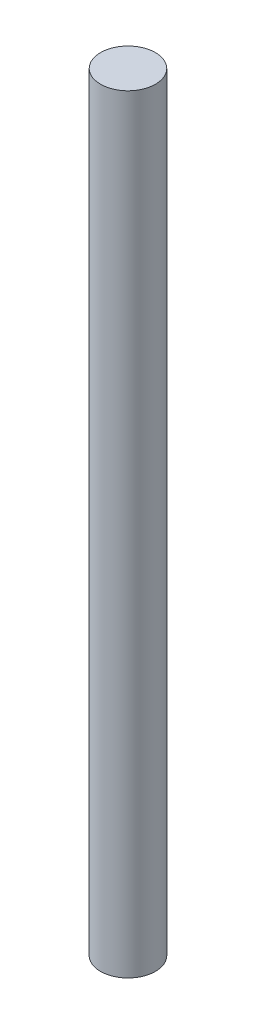
ISO-10303-21;
HEADER;
FILE_DESCRIPTION(('STEP AP214'),'2;1');
FILE_NAME('part.step','',(''),(''),'','','');
FILE_SCHEMA(('AUTOMOTIVE_DESIGN { 1 0 10303 214 1 1 1 1 }'));
ENDSEC;
DATA;
#1=APPLICATION_CONTEXT('core data for automotive mechanical design processes');
#2=APPLICATION_PROTOCOL_DEFINITION('international standard','automotive_design',2000,#1);
#3=PRODUCT_CONTEXT('',#1,'mechanical');
#4=PRODUCT('Part','Part','',(#3));
#5=PRODUCT_RELATED_PRODUCT_CATEGORY('part','',(#4));
#6=PRODUCT_DEFINITION_FORMATION('','',#4);
#7=PRODUCT_DEFINITION_CONTEXT('part definition',#1,'design');
#8=PRODUCT_DEFINITION('design','',#6,#7);
#9=PRODUCT_DEFINITION_SHAPE('','',#8);
#10=(LENGTH_UNIT() NAMED_UNIT(*) SI_UNIT(.MILLI.,.METRE.));
#11=(NAMED_UNIT(*) PLANE_ANGLE_UNIT() SI_UNIT($,.RADIAN.));
#12=(NAMED_UNIT(*) SI_UNIT($,.STERADIAN.) SOLID_ANGLE_UNIT());
#13=UNCERTAINTY_MEASURE_WITH_UNIT(LENGTH_MEASURE(1.E-05),#10,'distance_accuracy_value','');
#14=(GEOMETRIC_REPRESENTATION_CONTEXT(3) GLOBAL_UNCERTAINTY_ASSIGNED_CONTEXT((#13)) GLOBAL_UNIT_ASSIGNED_CONTEXT((#10,
#11,#12)) REPRESENTATION_CONTEXT('',''));
#15=CARTESIAN_POINT('',(0.,0.,0.));
#16=DIRECTION('',(0.,0.,1.));
#17=DIRECTION('',(1.,0.,0.));
#18=AXIS2_PLACEMENT_3D('',#15,#16,#17);
#19=CARTESIAN_POINT('',(0.,88.9,0.));
#20=DIRECTION('',(0.,-1.,0.));
#21=DIRECTION('',(0.,0.,-1.));
#22=AXIS2_PLACEMENT_3D('',#19,#20,#21);
#23=CYLINDRICAL_SURFACE('',#22,3.175);
#24=CARTESIAN_POINT('',(0.,88.9,0.));
#25=DIRECTION('',(0.,1.,0.));
#26=DIRECTION('',(0.,0.,1.));
#27=AXIS2_PLACEMENT_3D('',#24,#25,#26);
#28=CIRCLE('',#27,3.175);
#29=CARTESIAN_POINT('',(0.,88.9,3.175));
#30=VERTEX_POINT('',#29);
#31=EDGE_CURVE('E10',#30,#30,#28,.T.);
#32=ORIENTED_EDGE('',*,*,#31,.F.);
#33=EDGE_LOOP('',(#32));
#34=FACE_BOUND('',#33,.T.);
#35=CARTESIAN_POINT('',(0.,0.,0.));
#36=DIRECTION('',(0.,1.,0.));
#37=DIRECTION('',(0.,0.,1.));
#38=AXIS2_PLACEMENT_3D('',#35,#36,#37);
#39=CIRCLE('',#38,3.175);
#40=CARTESIAN_POINT('',(0.,0.,3.175));
#41=VERTEX_POINT('',#40);
#42=EDGE_CURVE('E34',#41,#41,#39,.T.);
#43=ORIENTED_EDGE('',*,*,#42,.T.);
#44=EDGE_LOOP('',(#43));
#45=FACE_BOUND('',#44,.T.);
#46=ADVANCED_FACE('F31',(#34,#45),#23,.T.);
#47=CARTESIAN_POINT('',(0.,88.9,0.));
#48=DIRECTION('',(0.,1.,0.));
#49=DIRECTION('',(0.,0.,1.));
#50=AXIS2_PLACEMENT_3D('',#47,#48,#49);
#51=PLANE('',#50);
#52=ORIENTED_EDGE('',*,*,#31,.T.);
#53=EDGE_LOOP('',(#52));
#54=FACE_BOUND('',#53,.T.);
#55=ADVANCED_FACE('F46',(#54),#51,.T.);
#56=CARTESIAN_POINT('',(0.,0.,0.));
#57=DIRECTION('',(0.,1.,0.));
#58=DIRECTION('',(0.,0.,1.));
#59=AXIS2_PLACEMENT_3D('',#56,#57,#58);
#60=PLANE('',#59);
#61=ORIENTED_EDGE('',*,*,#42,.F.);
#62=EDGE_LOOP('',(#61));
#63=FACE_BOUND('',#62,.T.);
#64=ADVANCED_FACE('F44',(#63),#60,.F.);
#65=CLOSED_SHELL('',(#46,#55,#64));
#66=MANIFOLD_SOLID_BREP('B2',#65);
#67=ADVANCED_BREP_SHAPE_REPRESENTATION('',(#18,#66),#14);
#68=SHAPE_DEFINITION_REPRESENTATION(#9,#67);
ENDSEC;
END-ISO-10303-21;
